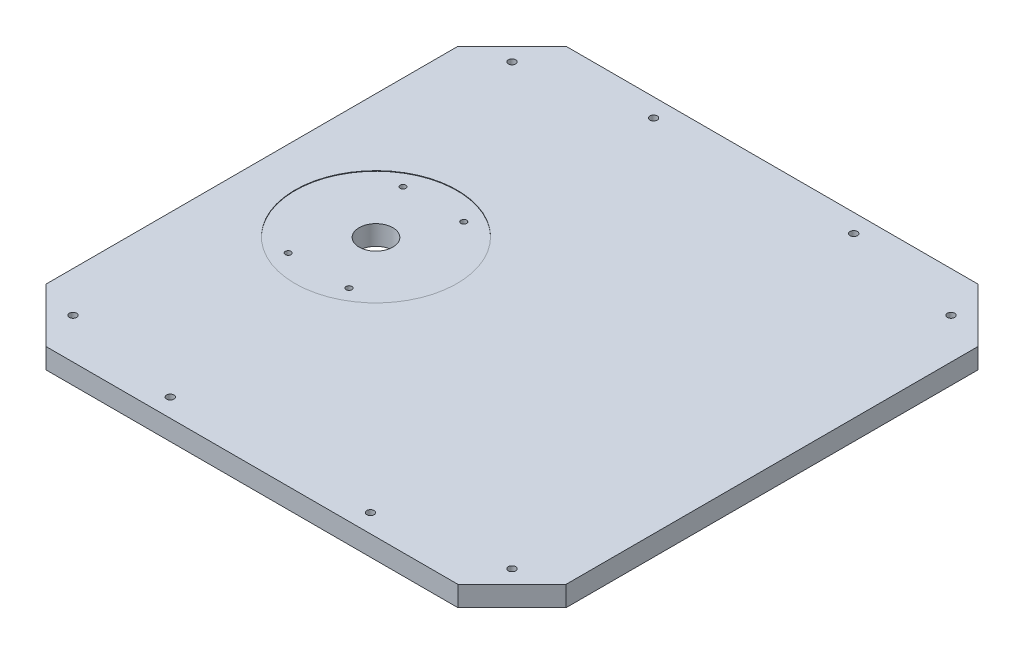
ISO-10303-21;
HEADER;
FILE_DESCRIPTION(('STEP AP214'),'2;1');
FILE_NAME('part.step','',(''),(''),'','','');
FILE_SCHEMA(('AUTOMOTIVE_DESIGN { 1 0 10303 214 1 1 1 1 }'));
ENDSEC;
DATA;
#1=APPLICATION_CONTEXT('core data for automotive mechanical design processes');
#2=APPLICATION_PROTOCOL_DEFINITION('international standard','automotive_design',2000,#1);
#3=PRODUCT_CONTEXT('',#1,'mechanical');
#4=PRODUCT('Part','Part','',(#3));
#5=PRODUCT_RELATED_PRODUCT_CATEGORY('part','',(#4));
#6=PRODUCT_DEFINITION_FORMATION('','',#4);
#7=PRODUCT_DEFINITION_CONTEXT('part definition',#1,'design');
#8=PRODUCT_DEFINITION('design','',#6,#7);
#9=PRODUCT_DEFINITION_SHAPE('','',#8);
#10=(LENGTH_UNIT() NAMED_UNIT(*) SI_UNIT(.MILLI.,.METRE.));
#11=(NAMED_UNIT(*) PLANE_ANGLE_UNIT() SI_UNIT($,.RADIAN.));
#12=(NAMED_UNIT(*) SI_UNIT($,.STERADIAN.) SOLID_ANGLE_UNIT());
#13=UNCERTAINTY_MEASURE_WITH_UNIT(LENGTH_MEASURE(1.E-05),#10,'distance_accuracy_value','');
#14=(GEOMETRIC_REPRESENTATION_CONTEXT(3) GLOBAL_UNCERTAINTY_ASSIGNED_CONTEXT((#13)) GLOBAL_UNIT_ASSIGNED_CONTEXT((#10,
#11,#12)) REPRESENTATION_CONTEXT('',''));
#15=CARTESIAN_POINT('',(0.,0.,0.));
#16=DIRECTION('',(0.,0.,1.));
#17=DIRECTION('',(1.,0.,0.));
#18=AXIS2_PLACEMENT_3D('',#15,#16,#17);
#19=CARTESIAN_POINT('',(-63.9445,9.525,0.));
#20=DIRECTION('',(0.,1.,0.));
#21=DIRECTION('',(0.,0.,1.));
#22=AXIS2_PLACEMENT_3D('',#19,#20,#21);
#23=CYLINDRICAL_SURFACE('',#22,7.9375);
#24=CARTESIAN_POINT('',(-63.9445,0.,0.));
#25=DIRECTION('',(0.,1.,0.));
#26=DIRECTION('',(0.,0.,1.));
#27=AXIS2_PLACEMENT_3D('',#24,#25,#26);
#28=CIRCLE('',#27,7.9375);
#29=CARTESIAN_POINT('',(-63.9445,0.,7.93749999999997));
#30=VERTEX_POINT('',#29);
#31=EDGE_CURVE('E209',#30,#30,#28,.T.);
#32=ORIENTED_EDGE('',*,*,#31,.F.);
#33=EDGE_LOOP('',(#32));
#34=FACE_BOUND('',#33,.T.);
#35=CARTESIAN_POINT('',(-63.9445,9.271,0.));
#36=DIRECTION('',(0.,1.,0.));
#37=DIRECTION('',(0.,0.,1.));
#38=AXIS2_PLACEMENT_3D('',#35,#36,#37);
#39=CIRCLE('',#38,7.9375);
#40=CARTESIAN_POINT('',(-63.9445,9.271,7.93749999999997));
#41=VERTEX_POINT('',#40);
#42=EDGE_CURVE('E238',#41,#41,#39,.F.);
#43=ORIENTED_EDGE('',*,*,#42,.F.);
#44=EDGE_LOOP('',(#43));
#45=FACE_BOUND('',#44,.T.);
#46=ADVANCED_FACE('F37',(#34,#45),#23,.F.);
#47=CARTESIAN_POINT('',(0.,0.,0.));
#48=DIRECTION('',(0.,-1.,0.));
#49=DIRECTION('',(0.,0.,-1.));
#50=AXIS2_PLACEMENT_3D('',#47,#48,#49);
#51=PLANE('',#50);
#52=CARTESIAN_POINT('',(-85.0011,0.,0.));
#53=DIRECTION('',(0.,-1.,0.));
#54=DIRECTION('',(0.,0.,-1.));
#55=AXIS2_PLACEMENT_3D('',#52,#53,#54);
#56=CIRCLE('',#55,3.96874999999999);
#57=CARTESIAN_POINT('',(-85.0011,0.,-3.96874999999999));
#58=VERTEX_POINT('',#57);
#59=EDGE_CURVE('E284',#58,#58,#56,.T.);
#60=ORIENTED_EDGE('',*,*,#59,.F.);
#61=EDGE_LOOP('',(#60));
#62=FACE_BOUND('',#61,.T.);
#63=CARTESIAN_POINT('',(85.0011,0.,52.5145));
#64=DIRECTION('',(0.,-1.,0.));
#65=DIRECTION('',(0.,0.,-1.));
#66=AXIS2_PLACEMENT_3D('',#63,#64,#65);
#67=CIRCLE('',#66,3.96874999999999);
#68=CARTESIAN_POINT('',(85.0011,0.,48.54575));
#69=VERTEX_POINT('',#68);
#70=EDGE_CURVE('E278',#69,#69,#67,.T.);
#71=ORIENTED_EDGE('',*,*,#70,.F.);
#72=EDGE_LOOP('',(#71));
#73=FACE_BOUND('',#72,.T.);
#74=CARTESIAN_POINT('',(85.0011,0.,-52.4891));
#75=DIRECTION('',(0.,-1.,0.));
#76=DIRECTION('',(0.,0.,-1.));
#77=AXIS2_PLACEMENT_3D('',#74,#75,#76);
#78=CIRCLE('',#77,3.96874999999999);
#79=CARTESIAN_POINT('',(85.0011,0.,-56.45785));
#80=VERTEX_POINT('',#79);
#81=EDGE_CURVE('E272',#80,#80,#78,.T.);
#82=ORIENTED_EDGE('',*,*,#81,.F.);
#83=EDGE_LOOP('',(#82));
#84=FACE_BOUND('',#83,.T.);
#85=CARTESIAN_POINT('',(-103.1875,0.,-103.1875));
#86=DIRECTION('',(0.,1.,0.));
#87=DIRECTION('',(0.,0.,1.));
#88=AXIS2_PLACEMENT_3D('',#85,#86,#87);
#89=CIRCLE('',#88,1.7272);
#90=CARTESIAN_POINT('',(-103.1875,0.,-101.4603));
#91=VERTEX_POINT('',#90);
#92=EDGE_CURVE('E263',#91,#91,#89,.T.);
#93=ORIENTED_EDGE('',*,*,#92,.T.);
#94=EDGE_LOOP('',(#93));
#95=FACE_BOUND('',#94,.T.);
#96=CARTESIAN_POINT('',(103.1875,0.,-103.1875));
#97=DIRECTION('',(0.,1.,0.));
#98=DIRECTION('',(0.,0.,1.));
#99=AXIS2_PLACEMENT_3D('',#96,#97,#98);
#100=CIRCLE('',#99,1.7272);
#101=CARTESIAN_POINT('',(103.1875,0.,-101.4603));
#102=VERTEX_POINT('',#101);
#103=EDGE_CURVE('E257',#102,#102,#100,.T.);
#104=ORIENTED_EDGE('',*,*,#103,.T.);
#105=EDGE_LOOP('',(#104));
#106=FACE_BOUND('',#105,.T.);
#107=CARTESIAN_POINT('',(103.187500000002,0.,103.1875));
#108=DIRECTION('',(0.,1.,0.));
#109=DIRECTION('',(0.,0.,1.));
#110=AXIS2_PLACEMENT_3D('',#107,#108,#109);
#111=CIRCLE('',#110,1.7272);
#112=CARTESIAN_POINT('',(103.187500000002,0.,104.9147));
#113=VERTEX_POINT('',#112);
#114=EDGE_CURVE('E251',#113,#113,#111,.T.);
#115=ORIENTED_EDGE('',*,*,#114,.T.);
#116=EDGE_LOOP('',(#115));
#117=FACE_BOUND('',#116,.T.);
#118=CARTESIAN_POINT('',(-103.187499999998,0.,103.1875));
#119=DIRECTION('',(0.,1.,0.));
#120=DIRECTION('',(0.,0.,1.));
#121=AXIS2_PLACEMENT_3D('',#118,#119,#120);
#122=CIRCLE('',#121,1.7272);
#123=CARTESIAN_POINT('',(-103.187499999998,0.,104.9147));
#124=VERTEX_POINT('',#123);
#125=EDGE_CURVE('E229',#124,#124,#122,.T.);
#126=ORIENTED_EDGE('',*,*,#125,.T.);
#127=EDGE_LOOP('',(#126));
#128=FACE_BOUND('',#127,.T.);
#129=DIRECTION('',(-1.,0.,0.));
#130=VECTOR('',#129,1.);
#131=CARTESIAN_POINT('',(96.8375,0.,-122.2375));
#132=LINE('',#131,#130);
#133=CARTESIAN_POINT('',(96.8375,0.,-122.2375));
#134=VERTEX_POINT('',#133);
#135=CARTESIAN_POINT('',(-96.8375,0.,-122.2375));
#136=VERTEX_POINT('',#135);
#137=EDGE_CURVE('E137',#134,#136,#132,.T.);
#138=ORIENTED_EDGE('',*,*,#137,.F.);
#139=DIRECTION('',(-0.707106781186547,0.,-0.707106781186548));
#140=VECTOR('',#139,1.);
#141=CARTESIAN_POINT('',(122.2375,0.,-96.8375));
#142=LINE('',#141,#140);
#143=CARTESIAN_POINT('',(122.2375,0.,-96.8375));
#144=VERTEX_POINT('',#143);
#145=EDGE_CURVE('E90',#144,#134,#142,.T.);
#146=ORIENTED_EDGE('',*,*,#145,.F.);
#147=DIRECTION('',(0.,0.,-1.));
#148=VECTOR('',#147,1.);
#149=CARTESIAN_POINT('',(122.2375,0.,96.8375));
#150=LINE('',#149,#148);
#151=CARTESIAN_POINT('',(122.2375,0.,96.8375));
#152=VERTEX_POINT('',#151);
#153=EDGE_CURVE('E84',#152,#144,#150,.T.);
#154=ORIENTED_EDGE('',*,*,#153,.F.);
#155=DIRECTION('',(0.707106781186547,0.,-0.707106781186547));
#156=VECTOR('',#155,1.);
#157=CARTESIAN_POINT('',(122.2375,0.,96.8375));
#158=LINE('',#157,#156);
#159=CARTESIAN_POINT('',(96.8375,0.,122.2375));
#160=VERTEX_POINT('',#159);
#161=EDGE_CURVE('E127',#160,#152,#158,.T.);
#162=ORIENTED_EDGE('',*,*,#161,.F.);
#163=DIRECTION('',(1.,0.,0.));
#164=VECTOR('',#163,1.);
#165=CARTESIAN_POINT('',(96.8375,0.,122.2375));
#166=LINE('',#165,#164);
#167=CARTESIAN_POINT('',(-96.8375,0.,122.2375));
#168=VERTEX_POINT('',#167);
#169=EDGE_CURVE('E147',#168,#160,#166,.T.);
#170=ORIENTED_EDGE('',*,*,#169,.F.);
#171=DIRECTION('',(0.707106781186547,0.,0.707106781186548));
#172=VECTOR('',#171,1.);
#173=CARTESIAN_POINT('',(-96.8375,0.,122.2375));
#174=LINE('',#173,#172);
#175=CARTESIAN_POINT('',(-122.2375,0.,96.8375));
#176=VERTEX_POINT('',#175);
#177=EDGE_CURVE('E145',#176,#168,#174,.T.);
#178=ORIENTED_EDGE('',*,*,#177,.F.);
#179=DIRECTION('',(0.,0.,1.));
#180=VECTOR('',#179,1.);
#181=CARTESIAN_POINT('',(-122.2375,0.,96.8375));
#182=LINE('',#181,#180);
#183=CARTESIAN_POINT('',(-122.2375,0.,-96.8375));
#184=VERTEX_POINT('',#183);
#185=EDGE_CURVE('E143',#184,#176,#182,.T.);
#186=ORIENTED_EDGE('',*,*,#185,.F.);
#187=DIRECTION('',(-0.707106781186547,0.,0.707106781186548));
#188=VECTOR('',#187,1.);
#189=CARTESIAN_POINT('',(-96.8375,0.,-122.2375));
#190=LINE('',#189,#188);
#191=EDGE_CURVE('E140',#136,#184,#190,.T.);
#192=ORIENTED_EDGE('',*,*,#191,.F.);
#193=EDGE_LOOP('',(#138,#146,#154,#162,#170,#178,#186,#192));
#194=FACE_BOUND('',#193,.T.);
#195=CARTESIAN_POINT('',(-47.0535,0.,113.6015));
#196=DIRECTION('',(0.,1.,0.));
#197=DIRECTION('',(0.,0.,1.));
#198=AXIS2_PLACEMENT_3D('',#195,#196,#197);
#199=CIRCLE('',#198,1.7272);
#200=CARTESIAN_POINT('',(-47.0535,0.,115.3287));
#201=VERTEX_POINT('',#200);
#202=EDGE_CURVE('E141',#201,#201,#199,.T.);
#203=ORIENTED_EDGE('',*,*,#202,.T.);
#204=EDGE_LOOP('',(#203));
#205=FACE_BOUND('',#204,.T.);
#206=CARTESIAN_POINT('',(47.0535,0.,113.6015));
#207=DIRECTION('',(0.,1.,0.));
#208=DIRECTION('',(0.,0.,1.));
#209=AXIS2_PLACEMENT_3D('',#206,#207,#208);
#210=CIRCLE('',#209,1.7272);
#211=CARTESIAN_POINT('',(47.0535,0.,115.3287));
#212=VERTEX_POINT('',#211);
#213=EDGE_CURVE('E191',#212,#212,#210,.T.);
#214=ORIENTED_EDGE('',*,*,#213,.T.);
#215=EDGE_LOOP('',(#214));
#216=FACE_BOUND('',#215,.T.);
#217=CARTESIAN_POINT('',(47.0535,0.,-113.6015));
#218=DIRECTION('',(0.,1.,0.));
#219=DIRECTION('',(0.,0.,1.));
#220=AXIS2_PLACEMENT_3D('',#217,#218,#219);
#221=CIRCLE('',#220,1.7272);
#222=CARTESIAN_POINT('',(47.0535,0.,-111.8743));
#223=VERTEX_POINT('',#222);
#224=EDGE_CURVE('E197',#223,#223,#221,.T.);
#225=ORIENTED_EDGE('',*,*,#224,.T.);
#226=EDGE_LOOP('',(#225));
#227=FACE_BOUND('',#226,.T.);
#228=CARTESIAN_POINT('',(-47.0535,0.,-113.6015));
#229=DIRECTION('',(0.,1.,0.));
#230=DIRECTION('',(0.,0.,1.));
#231=AXIS2_PLACEMENT_3D('',#228,#229,#230);
#232=CIRCLE('',#231,1.7272);
#233=CARTESIAN_POINT('',(-47.0535,0.,-111.8743));
#234=VERTEX_POINT('',#233);
#235=EDGE_CURVE('E203',#234,#234,#232,.T.);
#236=ORIENTED_EDGE('',*,*,#235,.T.);
#237=EDGE_LOOP('',(#236));
#238=FACE_BOUND('',#237,.T.);
#239=ORIENTED_EDGE('',*,*,#31,.T.);
#240=EDGE_LOOP('',(#239));
#241=FACE_BOUND('',#240,.T.);
#242=ADVANCED_FACE('F171',(#62,#73,#84,#95,#106,#117,#128,#194,#205,#216,#227,#238,#241),#51,.T.);
#243=CARTESIAN_POINT('',(96.8375,9.525,-122.2375));
#244=DIRECTION('',(0.,0.,1.));
#245=DIRECTION('',(1.,0.,0.));
#246=AXIS2_PLACEMENT_3D('',#243,#244,#245);
#247=PLANE('',#246);
#248=ORIENTED_EDGE('',*,*,#137,.T.);
#249=DIRECTION('',(0.,-1.,0.));
#250=VECTOR('',#249,1.);
#251=CARTESIAN_POINT('',(-96.8375,9.525,-122.2375));
#252=LINE('',#251,#250);
#253=CARTESIAN_POINT('',(-96.8375,9.525,-122.2375));
#254=VERTEX_POINT('',#253);
#255=EDGE_CURVE('E11',#254,#136,#252,.T.);
#256=ORIENTED_EDGE('',*,*,#255,.F.);
#257=DIRECTION('',(-1.,0.,0.));
#258=VECTOR('',#257,1.);
#259=CARTESIAN_POINT('',(96.8375,9.525,-122.2375));
#260=LINE('',#259,#258);
#261=CARTESIAN_POINT('',(96.8375,9.525,-122.2375));
#262=VERTEX_POINT('',#261);
#263=EDGE_CURVE('E152',#262,#254,#260,.T.);
#264=ORIENTED_EDGE('',*,*,#263,.F.);
#265=DIRECTION('',(0.,-1.,0.));
#266=VECTOR('',#265,1.);
#267=CARTESIAN_POINT('',(96.8375,9.525,-122.2375));
#268=LINE('',#267,#266);
#269=EDGE_CURVE('E133',#262,#134,#268,.T.);
#270=ORIENTED_EDGE('',*,*,#269,.T.);
#271=EDGE_LOOP('',(#248,#256,#264,#270));
#272=FACE_BOUND('',#271,.T.);
#273=ADVANCED_FACE('F39',(#272),#247,.F.);
#274=CARTESIAN_POINT('',(-96.8375,9.525,-122.2375));
#275=DIRECTION('',(0.707106781186548,0.,0.707106781186547));
#276=DIRECTION('',(0.707106781186547,0.,-0.707106781186548));
#277=AXIS2_PLACEMENT_3D('',#274,#275,#276);
#278=PLANE('',#277);
#279=ORIENTED_EDGE('',*,*,#191,.T.);
#280=DIRECTION('',(0.,-1.,0.));
#281=VECTOR('',#280,1.);
#282=CARTESIAN_POINT('',(-122.2375,9.525,-96.8375));
#283=LINE('',#282,#281);
#284=CARTESIAN_POINT('',(-122.2375,9.525,-96.8375));
#285=VERTEX_POINT('',#284);
#286=EDGE_CURVE('E46',#285,#184,#283,.T.);
#287=ORIENTED_EDGE('',*,*,#286,.F.);
#288=DIRECTION('',(-0.707106781186547,0.,0.707106781186548));
#289=VECTOR('',#288,1.);
#290=CARTESIAN_POINT('',(-96.8375,9.525,-122.2375));
#291=LINE('',#290,#289);
#292=EDGE_CURVE('E98',#254,#285,#291,.T.);
#293=ORIENTED_EDGE('',*,*,#292,.F.);
#294=ORIENTED_EDGE('',*,*,#255,.T.);
#295=EDGE_LOOP('',(#279,#287,#293,#294));
#296=FACE_BOUND('',#295,.T.);
#297=ADVANCED_FACE('F661',(#296),#278,.F.);
#298=CARTESIAN_POINT('',(-122.2375,9.525,96.8375));
#299=DIRECTION('',(1.,0.,0.));
#300=DIRECTION('',(0.,0.,-1.));
#301=AXIS2_PLACEMENT_3D('',#298,#299,#300);
#302=PLANE('',#301);
#303=ORIENTED_EDGE('',*,*,#185,.T.);
#304=DIRECTION('',(0.,-1.,0.));
#305=VECTOR('',#304,1.);
#306=CARTESIAN_POINT('',(-122.2375,9.525,96.8375));
#307=LINE('',#306,#305);
#308=CARTESIAN_POINT('',(-122.2375,9.525,96.8375));
#309=VERTEX_POINT('',#308);
#310=EDGE_CURVE('E159',#309,#176,#307,.T.);
#311=ORIENTED_EDGE('',*,*,#310,.F.);
#312=DIRECTION('',(0.,0.,1.));
#313=VECTOR('',#312,1.);
#314=CARTESIAN_POINT('',(-122.2375,9.525,96.8375));
#315=LINE('',#314,#313);
#316=EDGE_CURVE('E167',#285,#309,#315,.T.);
#317=ORIENTED_EDGE('',*,*,#316,.F.);
#318=ORIENTED_EDGE('',*,*,#286,.T.);
#319=EDGE_LOOP('',(#303,#311,#317,#318));
#320=FACE_BOUND('',#319,.T.);
#321=ADVANCED_FACE('F165',(#320),#302,.F.);
#322=CARTESIAN_POINT('',(-96.8375,9.525,122.2375));
#323=DIRECTION('',(0.707106781186548,0.,-0.707106781186547));
#324=DIRECTION('',(-0.707106781186547,0.,-0.707106781186548));
#325=AXIS2_PLACEMENT_3D('',#322,#323,#324);
#326=PLANE('',#325);
#327=ORIENTED_EDGE('',*,*,#177,.T.);
#328=DIRECTION('',(0.,-1.,0.));
#329=VECTOR('',#328,1.);
#330=CARTESIAN_POINT('',(-96.8375,9.525,122.2375));
#331=LINE('',#330,#329);
#332=CARTESIAN_POINT('',(-96.8375,9.525,122.2375));
#333=VERTEX_POINT('',#332);
#334=EDGE_CURVE('E156',#333,#168,#331,.T.);
#335=ORIENTED_EDGE('',*,*,#334,.F.);
#336=DIRECTION('',(0.707106781186547,0.,0.707106781186548));
#337=VECTOR('',#336,1.);
#338=CARTESIAN_POINT('',(-96.8375,9.525,122.2375));
#339=LINE('',#338,#337);
#340=EDGE_CURVE('E180',#309,#333,#339,.T.);
#341=ORIENTED_EDGE('',*,*,#340,.F.);
#342=ORIENTED_EDGE('',*,*,#310,.T.);
#343=EDGE_LOOP('',(#327,#335,#341,#342));
#344=FACE_BOUND('',#343,.T.);
#345=ADVANCED_FACE('F176',(#344),#326,.F.);
#346=CARTESIAN_POINT('',(96.8375,9.525,122.2375));
#347=DIRECTION('',(0.,0.,-1.));
#348=DIRECTION('',(-1.,0.,0.));
#349=AXIS2_PLACEMENT_3D('',#346,#347,#348);
#350=PLANE('',#349);
#351=ORIENTED_EDGE('',*,*,#169,.T.);
#352=DIRECTION('',(0.,-1.,0.));
#353=VECTOR('',#352,1.);
#354=CARTESIAN_POINT('',(96.8375,9.525,122.2375));
#355=LINE('',#354,#353);
#356=CARTESIAN_POINT('',(96.8375,9.525,122.2375));
#357=VERTEX_POINT('',#356);
#358=EDGE_CURVE('E128',#357,#160,#355,.T.);
#359=ORIENTED_EDGE('',*,*,#358,.F.);
#360=DIRECTION('',(1.,0.,0.));
#361=VECTOR('',#360,1.);
#362=CARTESIAN_POINT('',(96.8375,9.525,122.2375));
#363=LINE('',#362,#361);
#364=EDGE_CURVE('E119',#333,#357,#363,.T.);
#365=ORIENTED_EDGE('',*,*,#364,.F.);
#366=ORIENTED_EDGE('',*,*,#334,.T.);
#367=EDGE_LOOP('',(#351,#359,#365,#366));
#368=FACE_BOUND('',#367,.T.);
#369=ADVANCED_FACE('F179',(#368),#350,.F.);
#370=CARTESIAN_POINT('',(122.2375,9.525,96.8375));
#371=DIRECTION('',(-0.707106781186547,0.,-0.707106781186547));
#372=DIRECTION('',(-0.707106781186548,0.,0.707106781186548));
#373=AXIS2_PLACEMENT_3D('',#370,#371,#372);
#374=PLANE('',#373);
#375=ORIENTED_EDGE('',*,*,#161,.T.);
#376=DIRECTION('',(0.,-1.,0.));
#377=VECTOR('',#376,1.);
#378=CARTESIAN_POINT('',(122.2375,9.525,96.8375));
#379=LINE('',#378,#377);
#380=CARTESIAN_POINT('',(122.2375,9.525,96.8375));
#381=VERTEX_POINT('',#380);
#382=EDGE_CURVE('E124',#381,#152,#379,.T.);
#383=ORIENTED_EDGE('',*,*,#382,.F.);
#384=DIRECTION('',(0.707106781186547,0.,-0.707106781186547));
#385=VECTOR('',#384,1.);
#386=CARTESIAN_POINT('',(122.2375,9.525,96.8375));
#387=LINE('',#386,#385);
#388=EDGE_CURVE('E113',#357,#381,#387,.T.);
#389=ORIENTED_EDGE('',*,*,#388,.F.);
#390=ORIENTED_EDGE('',*,*,#358,.T.);
#391=EDGE_LOOP('',(#375,#383,#389,#390));
#392=FACE_BOUND('',#391,.T.);
#393=ADVANCED_FACE('F125',(#392),#374,.F.);
#394=CARTESIAN_POINT('',(122.2375,9.525,96.8375));
#395=DIRECTION('',(-1.,0.,0.));
#396=DIRECTION('',(0.,0.,1.));
#397=AXIS2_PLACEMENT_3D('',#394,#395,#396);
#398=PLANE('',#397);
#399=ORIENTED_EDGE('',*,*,#153,.T.);
#400=DIRECTION('',(0.,-1.,0.));
#401=VECTOR('',#400,1.);
#402=CARTESIAN_POINT('',(122.2375,9.525,-96.8375));
#403=LINE('',#402,#401);
#404=CARTESIAN_POINT('',(122.2375,9.525,-96.8375));
#405=VERTEX_POINT('',#404);
#406=EDGE_CURVE('E129',#405,#144,#403,.T.);
#407=ORIENTED_EDGE('',*,*,#406,.F.);
#408=DIRECTION('',(0.,0.,-1.));
#409=VECTOR('',#408,1.);
#410=CARTESIAN_POINT('',(122.2375,9.525,96.8375));
#411=LINE('',#410,#409);
#412=EDGE_CURVE('E117',#381,#405,#411,.T.);
#413=ORIENTED_EDGE('',*,*,#412,.F.);
#414=ORIENTED_EDGE('',*,*,#382,.T.);
#415=EDGE_LOOP('',(#399,#407,#413,#414));
#416=FACE_BOUND('',#415,.T.);
#417=ADVANCED_FACE('F131',(#416),#398,.F.);
#418=CARTESIAN_POINT('',(122.2375,9.525,-96.8375));
#419=DIRECTION('',(-0.707106781186548,0.,0.707106781186547));
#420=DIRECTION('',(0.707106781186547,0.,0.707106781186548));
#421=AXIS2_PLACEMENT_3D('',#418,#419,#420);
#422=PLANE('',#421);
#423=ORIENTED_EDGE('',*,*,#145,.T.);
#424=ORIENTED_EDGE('',*,*,#269,.F.);
#425=DIRECTION('',(-0.707106781186547,0.,-0.707106781186548));
#426=VECTOR('',#425,1.);
#427=CARTESIAN_POINT('',(122.2375,9.525,-96.8375));
#428=LINE('',#427,#426);
#429=EDGE_CURVE('E54',#405,#262,#428,.T.);
#430=ORIENTED_EDGE('',*,*,#429,.F.);
#431=ORIENTED_EDGE('',*,*,#406,.T.);
#432=EDGE_LOOP('',(#423,#424,#430,#431));
#433=FACE_BOUND('',#432,.T.);
#434=ADVANCED_FACE('F316',(#433),#422,.F.);
#435=CARTESIAN_POINT('',(0.,9.525,0.));
#436=DIRECTION('',(0.,-1.,0.));
#437=DIRECTION('',(0.,0.,-1.));
#438=AXIS2_PLACEMENT_3D('',#435,#436,#437);
#439=PLANE('',#438);
#440=CARTESIAN_POINT('',(-103.1875,9.525,-103.1875));
#441=DIRECTION('',(0.,1.,0.));
#442=DIRECTION('',(0.,0.,1.));
#443=AXIS2_PLACEMENT_3D('',#440,#441,#442);
#444=CIRCLE('',#443,1.72719999999998);
#445=CARTESIAN_POINT('',(-103.1875,9.525,-101.4603));
#446=VERTEX_POINT('',#445);
#447=EDGE_CURVE('E266',#446,#446,#444,.T.);
#448=ORIENTED_EDGE('',*,*,#447,.F.);
#449=EDGE_LOOP('',(#448));
#450=FACE_BOUND('',#449,.T.);
#451=CARTESIAN_POINT('',(103.1875,9.525,-103.1875));
#452=DIRECTION('',(0.,1.,0.));
#453=DIRECTION('',(0.,0.,1.));
#454=AXIS2_PLACEMENT_3D('',#451,#452,#453);
#455=CIRCLE('',#454,1.72719999999998);
#456=CARTESIAN_POINT('',(103.1875,9.525,-101.4603));
#457=VERTEX_POINT('',#456);
#458=EDGE_CURVE('E260',#457,#457,#455,.T.);
#459=ORIENTED_EDGE('',*,*,#458,.F.);
#460=EDGE_LOOP('',(#459));
#461=FACE_BOUND('',#460,.T.);
#462=CARTESIAN_POINT('',(103.187500000002,9.525,103.1875));
#463=DIRECTION('',(0.,1.,0.));
#464=DIRECTION('',(0.,0.,1.));
#465=AXIS2_PLACEMENT_3D('',#462,#463,#464);
#466=CIRCLE('',#465,1.72719999999998);
#467=CARTESIAN_POINT('',(103.187500000002,9.525,104.9147));
#468=VERTEX_POINT('',#467);
#469=EDGE_CURVE('E254',#468,#468,#466,.T.);
#470=ORIENTED_EDGE('',*,*,#469,.F.);
#471=EDGE_LOOP('',(#470));
#472=FACE_BOUND('',#471,.T.);
#473=CARTESIAN_POINT('',(-103.187499999998,9.525,103.1875));
#474=DIRECTION('',(0.,1.,0.));
#475=DIRECTION('',(0.,0.,1.));
#476=AXIS2_PLACEMENT_3D('',#473,#474,#475);
#477=CIRCLE('',#476,1.72719999999998);
#478=CARTESIAN_POINT('',(-103.187499999998,9.525,104.9147));
#479=VERTEX_POINT('',#478);
#480=EDGE_CURVE('E248',#479,#479,#477,.T.);
#481=ORIENTED_EDGE('',*,*,#480,.F.);
#482=EDGE_LOOP('',(#481));
#483=FACE_BOUND('',#482,.T.);
#484=CARTESIAN_POINT('',(-63.9445,9.525,0.));
#485=DIRECTION('',(0.,1.,0.));
#486=DIRECTION('',(0.,0.,1.));
#487=AXIS2_PLACEMENT_3D('',#484,#485,#486);
#488=CIRCLE('',#487,38.1);
#489=CARTESIAN_POINT('',(-63.9445,9.525,38.1));
#490=VERTEX_POINT('',#489);
#491=EDGE_CURVE('E225',#490,#490,#488,.T.);
#492=ORIENTED_EDGE('',*,*,#491,.F.);
#493=EDGE_LOOP('',(#492));
#494=FACE_BOUND('',#493,.T.);
#495=CARTESIAN_POINT('',(-47.0535,9.525,-113.6015));
#496=DIRECTION('',(0.,1.,0.));
#497=DIRECTION('',(0.,0.,1.));
#498=AXIS2_PLACEMENT_3D('',#495,#496,#497);
#499=CIRCLE('',#498,1.7272);
#500=CARTESIAN_POINT('',(-47.0535,9.525,-111.8743));
#501=VERTEX_POINT('',#500);
#502=EDGE_CURVE('E206',#501,#501,#499,.T.);
#503=ORIENTED_EDGE('',*,*,#502,.F.);
#504=EDGE_LOOP('',(#503));
#505=FACE_BOUND('',#504,.T.);
#506=CARTESIAN_POINT('',(47.0535,9.525,-113.6015));
#507=DIRECTION('',(0.,1.,0.));
#508=DIRECTION('',(0.,0.,1.));
#509=AXIS2_PLACEMENT_3D('',#506,#507,#508);
#510=CIRCLE('',#509,1.7272);
#511=CARTESIAN_POINT('',(47.0535,9.525,-111.8743));
#512=VERTEX_POINT('',#511);
#513=EDGE_CURVE('E200',#512,#512,#510,.T.);
#514=ORIENTED_EDGE('',*,*,#513,.F.);
#515=EDGE_LOOP('',(#514));
#516=FACE_BOUND('',#515,.T.);
#517=CARTESIAN_POINT('',(47.0535,9.525,113.6015));
#518=DIRECTION('',(0.,1.,0.));
#519=DIRECTION('',(0.,0.,1.));
#520=AXIS2_PLACEMENT_3D('',#517,#518,#519);
#521=CIRCLE('',#520,1.7272);
#522=CARTESIAN_POINT('',(47.0535,9.525,115.3287));
#523=VERTEX_POINT('',#522);
#524=EDGE_CURVE('E194',#523,#523,#521,.T.);
#525=ORIENTED_EDGE('',*,*,#524,.F.);
#526=EDGE_LOOP('',(#525));
#527=FACE_BOUND('',#526,.T.);
#528=CARTESIAN_POINT('',(-47.0535,9.525,113.6015));
#529=DIRECTION('',(0.,1.,0.));
#530=DIRECTION('',(0.,0.,1.));
#531=AXIS2_PLACEMENT_3D('',#528,#529,#530);
#532=CIRCLE('',#531,1.7272);
#533=CARTESIAN_POINT('',(-47.0535,9.525,115.3287));
#534=VERTEX_POINT('',#533);
#535=EDGE_CURVE('E188',#534,#534,#532,.T.);
#536=ORIENTED_EDGE('',*,*,#535,.F.);
#537=EDGE_LOOP('',(#536));
#538=FACE_BOUND('',#537,.T.);
#539=ORIENTED_EDGE('',*,*,#263,.T.);
#540=ORIENTED_EDGE('',*,*,#292,.T.);
#541=ORIENTED_EDGE('',*,*,#316,.T.);
#542=ORIENTED_EDGE('',*,*,#340,.T.);
#543=ORIENTED_EDGE('',*,*,#364,.T.);
#544=ORIENTED_EDGE('',*,*,#388,.T.);
#545=ORIENTED_EDGE('',*,*,#412,.T.);
#546=ORIENTED_EDGE('',*,*,#429,.T.);
#547=EDGE_LOOP('',(#539,#540,#541,#542,#543,#544,#545,#546));
#548=FACE_BOUND('',#547,.T.);
#549=ADVANCED_FACE('F115',(#450,#461,#472,#483,#494,#505,#516,#527,#538,#548),#439,.F.);
#550=CARTESIAN_POINT('',(-47.0535,9.525,113.6015));
#551=DIRECTION('',(0.,1.,0.));
#552=DIRECTION('',(0.,0.,1.));
#553=AXIS2_PLACEMENT_3D('',#550,#551,#552);
#554=CYLINDRICAL_SURFACE('',#553,1.7272);
#555=ORIENTED_EDGE('',*,*,#202,.F.);
#556=EDGE_LOOP('',(#555));
#557=FACE_BOUND('',#556,.T.);
#558=ORIENTED_EDGE('',*,*,#535,.T.);
#559=EDGE_LOOP('',(#558));
#560=FACE_BOUND('',#559,.T.);
#561=ADVANCED_FACE('F315',(#557,#560),#554,.F.);
#562=CARTESIAN_POINT('',(47.0535,9.525,113.6015));
#563=DIRECTION('',(0.,1.,0.));
#564=DIRECTION('',(0.,0.,1.));
#565=AXIS2_PLACEMENT_3D('',#562,#563,#564);
#566=CYLINDRICAL_SURFACE('',#565,1.7272);
#567=ORIENTED_EDGE('',*,*,#213,.F.);
#568=EDGE_LOOP('',(#567));
#569=FACE_BOUND('',#568,.T.);
#570=ORIENTED_EDGE('',*,*,#524,.T.);
#571=EDGE_LOOP('',(#570));
#572=FACE_BOUND('',#571,.T.);
#573=ADVANCED_FACE('F330',(#569,#572),#566,.F.);
#574=CARTESIAN_POINT('',(47.0535,9.525,-113.6015));
#575=DIRECTION('',(0.,1.,0.));
#576=DIRECTION('',(0.,0.,1.));
#577=AXIS2_PLACEMENT_3D('',#574,#575,#576);
#578=CYLINDRICAL_SURFACE('',#577,1.7272);
#579=ORIENTED_EDGE('',*,*,#224,.F.);
#580=EDGE_LOOP('',(#579));
#581=FACE_BOUND('',#580,.T.);
#582=ORIENTED_EDGE('',*,*,#513,.T.);
#583=EDGE_LOOP('',(#582));
#584=FACE_BOUND('',#583,.T.);
#585=ADVANCED_FACE('F336',(#581,#584),#578,.F.);
#586=CARTESIAN_POINT('',(-47.0535,9.525,-113.6015));
#587=DIRECTION('',(0.,1.,0.));
#588=DIRECTION('',(0.,0.,1.));
#589=AXIS2_PLACEMENT_3D('',#586,#587,#588);
#590=CYLINDRICAL_SURFACE('',#589,1.7272);
#591=ORIENTED_EDGE('',*,*,#235,.F.);
#592=EDGE_LOOP('',(#591));
#593=FACE_BOUND('',#592,.T.);
#594=ORIENTED_EDGE('',*,*,#502,.T.);
#595=EDGE_LOOP('',(#594));
#596=FACE_BOUND('',#595,.T.);
#597=ADVANCED_FACE('F351',(#593,#596),#590,.F.);
#598=CARTESIAN_POINT('',(-63.9445,9.271,0.));
#599=DIRECTION('',(0.,1.,0.));
#600=DIRECTION('',(0.,0.,1.));
#601=AXIS2_PLACEMENT_3D('',#598,#599,#600);
#602=CYLINDRICAL_SURFACE('',#601,38.1);
#603=CARTESIAN_POINT('',(-63.9445,9.271,0.));
#604=DIRECTION('',(0.,1.,0.));
#605=DIRECTION('',(0.,0.,1.));
#606=AXIS2_PLACEMENT_3D('',#603,#604,#605);
#607=CIRCLE('',#606,38.1);
#608=CARTESIAN_POINT('',(-63.9445,9.271,38.1));
#609=VERTEX_POINT('',#608);
#610=EDGE_CURVE('E224',#609,#609,#607,.T.);
#611=ORIENTED_EDGE('',*,*,#610,.F.);
#612=EDGE_LOOP('',(#611));
#613=FACE_BOUND('',#612,.T.);
#614=ORIENTED_EDGE('',*,*,#491,.T.);
#615=EDGE_LOOP('',(#614));
#616=FACE_BOUND('',#615,.T.);
#617=ADVANCED_FACE('F354',(#613,#616),#602,.F.);
#618=CARTESIAN_POINT('',(0.,9.271,0.));
#619=DIRECTION('',(0.,1.,0.));
#620=DIRECTION('',(0.,0.,1.));
#621=AXIS2_PLACEMENT_3D('',#618,#619,#620);
#622=PLANE('',#621);
#623=CARTESIAN_POINT('',(-78.232,9.271,26.9875));
#624=DIRECTION('',(0.,1.,0.));
#625=DIRECTION('',(0.,0.,1.));
#626=AXIS2_PLACEMENT_3D('',#623,#624,#625);
#627=CIRCLE('',#626,1.35254999999999);
#628=CARTESIAN_POINT('',(-78.232,9.271,28.34005));
#629=VERTEX_POINT('',#628);
#630=EDGE_CURVE('E228',#629,#629,#627,.F.);
#631=ORIENTED_EDGE('',*,*,#630,.T.);
#632=EDGE_LOOP('',(#631));
#633=FACE_BOUND('',#632,.T.);
#634=CARTESIAN_POINT('',(-49.6570000000002,9.271,-26.9875));
#635=DIRECTION('',(0.,1.,0.));
#636=DIRECTION('',(0.,0.,1.));
#637=AXIS2_PLACEMENT_3D('',#634,#635,#636);
#638=CIRCLE('',#637,1.35254999999999);
#639=CARTESIAN_POINT('',(-49.6570000000002,9.271,-25.63495));
#640=VERTEX_POINT('',#639);
#641=EDGE_CURVE('E241',#640,#640,#638,.F.);
#642=ORIENTED_EDGE('',*,*,#641,.T.);
#643=EDGE_LOOP('',(#642));
#644=FACE_BOUND('',#643,.T.);
#645=ORIENTED_EDGE('',*,*,#42,.T.);
#646=EDGE_LOOP('',(#645));
#647=FACE_BOUND('',#646,.T.);
#648=CARTESIAN_POINT('',(-78.2320000000002,9.271,-26.9875));
#649=DIRECTION('',(0.,1.,0.));
#650=DIRECTION('',(0.,0.,1.));
#651=AXIS2_PLACEMENT_3D('',#648,#649,#650);
#652=CIRCLE('',#651,1.35254999999999);
#653=CARTESIAN_POINT('',(-78.2320000000002,9.271,-25.63495));
#654=VERTEX_POINT('',#653);
#655=EDGE_CURVE('E235',#654,#654,#652,.F.);
#656=ORIENTED_EDGE('',*,*,#655,.T.);
#657=EDGE_LOOP('',(#656));
#658=FACE_BOUND('',#657,.T.);
#659=CARTESIAN_POINT('',(-49.657,9.271,26.9875));
#660=DIRECTION('',(0.,1.,0.));
#661=DIRECTION('',(0.,0.,1.));
#662=AXIS2_PLACEMENT_3D('',#659,#660,#661);
#663=CIRCLE('',#662,1.35254999999999);
#664=CARTESIAN_POINT('',(-49.657,9.271,28.34005));
#665=VERTEX_POINT('',#664);
#666=EDGE_CURVE('E232',#665,#665,#663,.F.);
#667=ORIENTED_EDGE('',*,*,#666,.T.);
#668=EDGE_LOOP('',(#667));
#669=FACE_BOUND('',#668,.T.);
#670=ORIENTED_EDGE('',*,*,#610,.T.);
#671=EDGE_LOOP('',(#670));
#672=FACE_BOUND('',#671,.T.);
#673=ADVANCED_FACE('F380',(#633,#644,#647,#658,#669,#672),#622,.T.);
#674=CARTESIAN_POINT('',(-49.657,1.397,26.9875));
#675=DIRECTION('',(0.,1.,0.));
#676=DIRECTION('',(0.,0.,1.));
#677=AXIS2_PLACEMENT_3D('',#674,#675,#676);
#678=CONICAL_SURFACE('',#677,1.35255,1.02974425867665);
#679=CARTESIAN_POINT('',(-49.657,0.584305969734272,26.9875));
#680=VERTEX_POINT('',#679);
#681=VERTEX_LOOP('',#680);
#682=FACE_BOUND('',#681,.T.);
#683=CARTESIAN_POINT('',(-49.657,1.397,26.9875));
#684=DIRECTION('',(0.,1.,0.));
#685=DIRECTION('',(0.,0.,1.));
#686=AXIS2_PLACEMENT_3D('',#683,#684,#685);
#687=CIRCLE('',#686,1.35255);
#688=CARTESIAN_POINT('',(-49.657,1.397,28.34005));
#689=VERTEX_POINT('',#688);
#690=EDGE_CURVE('E218',#689,#689,#687,.T.);
#691=ORIENTED_EDGE('',*,*,#690,.T.);
#692=EDGE_LOOP('',(#691));
#693=FACE_BOUND('',#692,.T.);
#694=ADVANCED_FACE('F388',(#682,#693),#678,.F.);
#695=CARTESIAN_POINT('',(-49.657,9.525,26.9875));
#696=DIRECTION('',(0.,1.,0.));
#697=DIRECTION('',(0.,0.,1.));
#698=AXIS2_PLACEMENT_3D('',#695,#696,#697);
#699=CYLINDRICAL_SURFACE('',#698,1.35254999999999);
#700=ORIENTED_EDGE('',*,*,#690,.F.);
#701=EDGE_LOOP('',(#700));
#702=FACE_BOUND('',#701,.T.);
#703=ORIENTED_EDGE('',*,*,#666,.F.);
#704=EDGE_LOOP('',(#703));
#705=FACE_BOUND('',#704,.T.);
#706=ADVANCED_FACE('F397',(#702,#705),#699,.F.);
#707=CARTESIAN_POINT('',(-49.6570000000002,1.397,-26.9875));
#708=DIRECTION('',(0.,1.,0.));
#709=DIRECTION('',(0.,0.,1.));
#710=AXIS2_PLACEMENT_3D('',#707,#708,#709);
#711=CONICAL_SURFACE('',#710,1.35255,1.02974425867665);
#712=CARTESIAN_POINT('',(-49.6570000000002,0.584305969734272,-26.9875));
#713=VERTEX_POINT('',#712);
#714=VERTEX_LOOP('',#713);
#715=FACE_BOUND('',#714,.T.);
#716=CARTESIAN_POINT('',(-49.6570000000002,1.397,-26.9875));
#717=DIRECTION('',(0.,1.,0.));
#718=DIRECTION('',(0.,0.,1.));
#719=AXIS2_PLACEMENT_3D('',#716,#717,#718);
#720=CIRCLE('',#719,1.35255);
#721=CARTESIAN_POINT('',(-49.6570000000002,1.397,-25.63495));
#722=VERTEX_POINT('',#721);
#723=EDGE_CURVE('E215',#722,#722,#720,.T.);
#724=ORIENTED_EDGE('',*,*,#723,.T.);
#725=EDGE_LOOP('',(#724));
#726=FACE_BOUND('',#725,.T.);
#727=ADVANCED_FACE('F407',(#715,#726),#711,.F.);
#728=CARTESIAN_POINT('',(-49.6570000000002,9.525,-26.9875));
#729=DIRECTION('',(0.,1.,0.));
#730=DIRECTION('',(0.,0.,1.));
#731=AXIS2_PLACEMENT_3D('',#728,#729,#730);
#732=CYLINDRICAL_SURFACE('',#731,1.35254999999999);
#733=ORIENTED_EDGE('',*,*,#723,.F.);
#734=EDGE_LOOP('',(#733));
#735=FACE_BOUND('',#734,.T.);
#736=ORIENTED_EDGE('',*,*,#641,.F.);
#737=EDGE_LOOP('',(#736));
#738=FACE_BOUND('',#737,.T.);
#739=ADVANCED_FACE('F414',(#735,#738),#732,.F.);
#740=CARTESIAN_POINT('',(-78.2320000000002,1.397,-26.9875));
#741=DIRECTION('',(0.,1.,0.));
#742=DIRECTION('',(0.,0.,1.));
#743=AXIS2_PLACEMENT_3D('',#740,#741,#742);
#744=CONICAL_SURFACE('',#743,1.35254999999999,1.02974425867665);
#745=CARTESIAN_POINT('',(-78.2320000000002,0.584305969734272,-26.9875));
#746=VERTEX_POINT('',#745);
#747=VERTEX_LOOP('',#746);
#748=FACE_BOUND('',#747,.T.);
#749=CARTESIAN_POINT('',(-78.2320000000002,1.397,-26.9875));
#750=DIRECTION('',(0.,1.,0.));
#751=DIRECTION('',(0.,0.,1.));
#752=AXIS2_PLACEMENT_3D('',#749,#750,#751);
#753=CIRCLE('',#752,1.35254999999999);
#754=CARTESIAN_POINT('',(-78.2320000000002,1.397,-25.63495));
#755=VERTEX_POINT('',#754);
#756=EDGE_CURVE('E212',#755,#755,#753,.T.);
#757=ORIENTED_EDGE('',*,*,#756,.T.);
#758=EDGE_LOOP('',(#757));
#759=FACE_BOUND('',#758,.T.);
#760=ADVANCED_FACE('F349',(#748,#759),#744,.F.);
#761=CARTESIAN_POINT('',(-78.2320000000002,9.525,-26.9875));
#762=DIRECTION('',(0.,1.,0.));
#763=DIRECTION('',(0.,0.,1.));
#764=AXIS2_PLACEMENT_3D('',#761,#762,#763);
#765=CYLINDRICAL_SURFACE('',#764,1.35254999999999);
#766=ORIENTED_EDGE('',*,*,#756,.F.);
#767=EDGE_LOOP('',(#766));
#768=FACE_BOUND('',#767,.T.);
#769=ORIENTED_EDGE('',*,*,#655,.F.);
#770=EDGE_LOOP('',(#769));
#771=FACE_BOUND('',#770,.T.);
#772=ADVANCED_FACE('F429',(#768,#771),#765,.F.);
#773=CARTESIAN_POINT('',(-78.232,1.397,26.9875));
#774=DIRECTION('',(0.,1.,0.));
#775=DIRECTION('',(0.,0.,1.));
#776=AXIS2_PLACEMENT_3D('',#773,#774,#775);
#777=CONICAL_SURFACE('',#776,1.35254999999999,1.02974425867665);
#778=CARTESIAN_POINT('',(-78.232,0.584305969734272,26.9875));
#779=VERTEX_POINT('',#778);
#780=VERTEX_LOOP('',#779);
#781=FACE_BOUND('',#780,.T.);
#782=CARTESIAN_POINT('',(-78.232,1.397,26.9875));
#783=DIRECTION('',(0.,1.,0.));
#784=DIRECTION('',(0.,0.,1.));
#785=AXIS2_PLACEMENT_3D('',#782,#783,#784);
#786=CIRCLE('',#785,1.35254999999999);
#787=CARTESIAN_POINT('',(-78.232,1.397,28.34005));
#788=VERTEX_POINT('',#787);
#789=EDGE_CURVE('E221',#788,#788,#786,.T.);
#790=ORIENTED_EDGE('',*,*,#789,.T.);
#791=EDGE_LOOP('',(#790));
#792=FACE_BOUND('',#791,.T.);
#793=ADVANCED_FACE('F435',(#781,#792),#777,.F.);
#794=CARTESIAN_POINT('',(-78.232,9.525,26.9875));
#795=DIRECTION('',(0.,1.,0.));
#796=DIRECTION('',(0.,0.,1.));
#797=AXIS2_PLACEMENT_3D('',#794,#795,#796);
#798=CYLINDRICAL_SURFACE('',#797,1.35254999999999);
#799=ORIENTED_EDGE('',*,*,#789,.F.);
#800=EDGE_LOOP('',(#799));
#801=FACE_BOUND('',#800,.T.);
#802=ORIENTED_EDGE('',*,*,#630,.F.);
#803=EDGE_LOOP('',(#802));
#804=FACE_BOUND('',#803,.T.);
#805=ADVANCED_FACE('F309',(#801,#804),#798,.F.);
#806=CARTESIAN_POINT('',(-103.187499999998,9.525,103.1875));
#807=DIRECTION('',(0.,1.,0.));
#808=DIRECTION('',(0.,0.,1.));
#809=AXIS2_PLACEMENT_3D('',#806,#807,#808);
#810=CYLINDRICAL_SURFACE('',#809,1.72719999999999);
#811=ORIENTED_EDGE('',*,*,#125,.F.);
#812=EDGE_LOOP('',(#811));
#813=FACE_BOUND('',#812,.T.);
#814=ORIENTED_EDGE('',*,*,#480,.T.);
#815=EDGE_LOOP('',(#814));
#816=FACE_BOUND('',#815,.T.);
#817=ADVANCED_FACE('F305',(#813,#816),#810,.F.);
#818=CARTESIAN_POINT('',(103.187500000002,9.525,103.1875));
#819=DIRECTION('',(0.,1.,0.));
#820=DIRECTION('',(0.,0.,1.));
#821=AXIS2_PLACEMENT_3D('',#818,#819,#820);
#822=CYLINDRICAL_SURFACE('',#821,1.72719999999999);
#823=ORIENTED_EDGE('',*,*,#114,.F.);
#824=EDGE_LOOP('',(#823));
#825=FACE_BOUND('',#824,.T.);
#826=ORIENTED_EDGE('',*,*,#469,.T.);
#827=EDGE_LOOP('',(#826));
#828=FACE_BOUND('',#827,.T.);
#829=ADVANCED_FACE('F308',(#825,#828),#822,.F.);
#830=CARTESIAN_POINT('',(103.1875,9.525,-103.1875));
#831=DIRECTION('',(0.,1.,0.));
#832=DIRECTION('',(0.,0.,1.));
#833=AXIS2_PLACEMENT_3D('',#830,#831,#832);
#834=CYLINDRICAL_SURFACE('',#833,1.72719999999999);
#835=ORIENTED_EDGE('',*,*,#103,.F.);
#836=EDGE_LOOP('',(#835));
#837=FACE_BOUND('',#836,.T.);
#838=ORIENTED_EDGE('',*,*,#458,.T.);
#839=EDGE_LOOP('',(#838));
#840=FACE_BOUND('',#839,.T.);
#841=ADVANCED_FACE('F458',(#837,#840),#834,.F.);
#842=CARTESIAN_POINT('',(-103.1875,9.525,-103.1875));
#843=DIRECTION('',(0.,1.,0.));
#844=DIRECTION('',(0.,0.,1.));
#845=AXIS2_PLACEMENT_3D('',#842,#843,#844);
#846=CYLINDRICAL_SURFACE('',#845,1.72719999999999);
#847=ORIENTED_EDGE('',*,*,#92,.F.);
#848=EDGE_LOOP('',(#847));
#849=FACE_BOUND('',#848,.T.);
#850=ORIENTED_EDGE('',*,*,#447,.T.);
#851=EDGE_LOOP('',(#850));
#852=FACE_BOUND('',#851,.T.);
#853=ADVANCED_FACE('F466',(#849,#852),#846,.F.);
#854=CARTESIAN_POINT('',(85.0011,5.08,-52.4891));
#855=DIRECTION('',(0.,-1.,0.));
#856=DIRECTION('',(0.,0.,-1.));
#857=AXIS2_PLACEMENT_3D('',#854,#855,#856);
#858=CONICAL_SURFACE('',#857,3.96874999999999,1.02974425867665);
#859=CARTESIAN_POINT('',(85.0011,7.46466558176563,-52.4891));
#860=VERTEX_POINT('',#859);
#861=VERTEX_LOOP('',#860);
#862=FACE_BOUND('',#861,.T.);
#863=CARTESIAN_POINT('',(85.0011,5.08,-52.4891));
#864=DIRECTION('',(0.,-1.,0.));
#865=DIRECTION('',(0.,0.,-1.));
#866=AXIS2_PLACEMENT_3D('',#863,#864,#865);
#867=CIRCLE('',#866,3.96874999999999);
#868=CARTESIAN_POINT('',(85.0011,5.08,-56.45785));
#869=VERTEX_POINT('',#868);
#870=EDGE_CURVE('E269',#869,#869,#867,.T.);
#871=ORIENTED_EDGE('',*,*,#870,.T.);
#872=EDGE_LOOP('',(#871));
#873=FACE_BOUND('',#872,.T.);
#874=ADVANCED_FACE('F474',(#862,#873),#858,.F.);
#875=CARTESIAN_POINT('',(85.0011,0.,-52.4891));
#876=DIRECTION('',(0.,-1.,0.));
#877=DIRECTION('',(0.,0.,-1.));
#878=AXIS2_PLACEMENT_3D('',#875,#876,#877);
#879=CYLINDRICAL_SURFACE('',#878,3.96874999999999);
#880=ORIENTED_EDGE('',*,*,#870,.F.);
#881=EDGE_LOOP('',(#880));
#882=FACE_BOUND('',#881,.T.);
#883=ORIENTED_EDGE('',*,*,#81,.T.);
#884=EDGE_LOOP('',(#883));
#885=FACE_BOUND('',#884,.T.);
#886=ADVANCED_FACE('F482',(#882,#885),#879,.F.);
#887=CARTESIAN_POINT('',(85.0011,5.08,52.5145));
#888=DIRECTION('',(0.,-1.,0.));
#889=DIRECTION('',(0.,0.,-1.));
#890=AXIS2_PLACEMENT_3D('',#887,#888,#889);
#891=CONICAL_SURFACE('',#890,3.96874999999999,1.02974425867665);
#892=CARTESIAN_POINT('',(85.0011,7.46466558176563,52.5145));
#893=VERTEX_POINT('',#892);
#894=VERTEX_LOOP('',#893);
#895=FACE_BOUND('',#894,.T.);
#896=CARTESIAN_POINT('',(85.0011,5.08,52.5145));
#897=DIRECTION('',(0.,-1.,0.));
#898=DIRECTION('',(0.,0.,-1.));
#899=AXIS2_PLACEMENT_3D('',#896,#897,#898);
#900=CIRCLE('',#899,3.96874999999999);
#901=CARTESIAN_POINT('',(85.0011,5.08,48.54575));
#902=VERTEX_POINT('',#901);
#903=EDGE_CURVE('E275',#902,#902,#900,.T.);
#904=ORIENTED_EDGE('',*,*,#903,.T.);
#905=EDGE_LOOP('',(#904));
#906=FACE_BOUND('',#905,.T.);
#907=ADVANCED_FACE('F491',(#895,#906),#891,.F.);
#908=CARTESIAN_POINT('',(85.0011,0.,52.5145));
#909=DIRECTION('',(0.,-1.,0.));
#910=DIRECTION('',(0.,0.,-1.));
#911=AXIS2_PLACEMENT_3D('',#908,#909,#910);
#912=CYLINDRICAL_SURFACE('',#911,3.96874999999999);
#913=ORIENTED_EDGE('',*,*,#903,.F.);
#914=EDGE_LOOP('',(#913));
#915=FACE_BOUND('',#914,.T.);
#916=ORIENTED_EDGE('',*,*,#70,.T.);
#917=EDGE_LOOP('',(#916));
#918=FACE_BOUND('',#917,.T.);
#919=ADVANCED_FACE('F499',(#915,#918),#912,.F.);
#920=CARTESIAN_POINT('',(-85.0011,5.08,0.));
#921=DIRECTION('',(0.,-1.,0.));
#922=DIRECTION('',(0.,0.,-1.));
#923=AXIS2_PLACEMENT_3D('',#920,#921,#922);
#924=CONICAL_SURFACE('',#923,3.96874999999999,1.02974425867665);
#925=CARTESIAN_POINT('',(-85.0011,7.46466558176563,0.));
#926=VERTEX_POINT('',#925);
#927=VERTEX_LOOP('',#926);
#928=FACE_BOUND('',#927,.T.);
#929=CARTESIAN_POINT('',(-85.0011,5.08,0.));
#930=DIRECTION('',(0.,-1.,0.));
#931=DIRECTION('',(0.,0.,-1.));
#932=AXIS2_PLACEMENT_3D('',#929,#930,#931);
#933=CIRCLE('',#932,3.96874999999999);
#934=CARTESIAN_POINT('',(-85.0011,5.08,-3.96874999999999));
#935=VERTEX_POINT('',#934);
#936=EDGE_CURVE('E281',#935,#935,#933,.T.);
#937=ORIENTED_EDGE('',*,*,#936,.T.);
#938=EDGE_LOOP('',(#937));
#939=FACE_BOUND('',#938,.T.);
#940=ADVANCED_FACE('F507',(#928,#939),#924,.F.);
#941=CARTESIAN_POINT('',(-85.0011,0.,0.));
#942=DIRECTION('',(0.,-1.,0.));
#943=DIRECTION('',(0.,0.,-1.));
#944=AXIS2_PLACEMENT_3D('',#941,#942,#943);
#945=CYLINDRICAL_SURFACE('',#944,3.96874999999999);
#946=ORIENTED_EDGE('',*,*,#936,.F.);
#947=EDGE_LOOP('',(#946));
#948=FACE_BOUND('',#947,.T.);
#949=ORIENTED_EDGE('',*,*,#59,.T.);
#950=EDGE_LOOP('',(#949));
#951=FACE_BOUND('',#950,.T.);
#952=ADVANCED_FACE('F288',(#948,#951),#945,.F.);
#953=CLOSED_SHELL('',(#46,#242,#273,#297,#321,#345,#369,#393,#417,#434,#549,#561,#573,#585,#597,
#617,#673,#694,#706,#727,#739,#760,#772,#793,#805,#817,#829,#841,#853,#874,#886,#907,#919,#940,#952));
#954=MANIFOLD_SOLID_BREP('B2',#953);
#955=ADVANCED_BREP_SHAPE_REPRESENTATION('',(#18,#954),#14);
#956=SHAPE_DEFINITION_REPRESENTATION(#9,#955);
ENDSEC;
END-ISO-10303-21;
